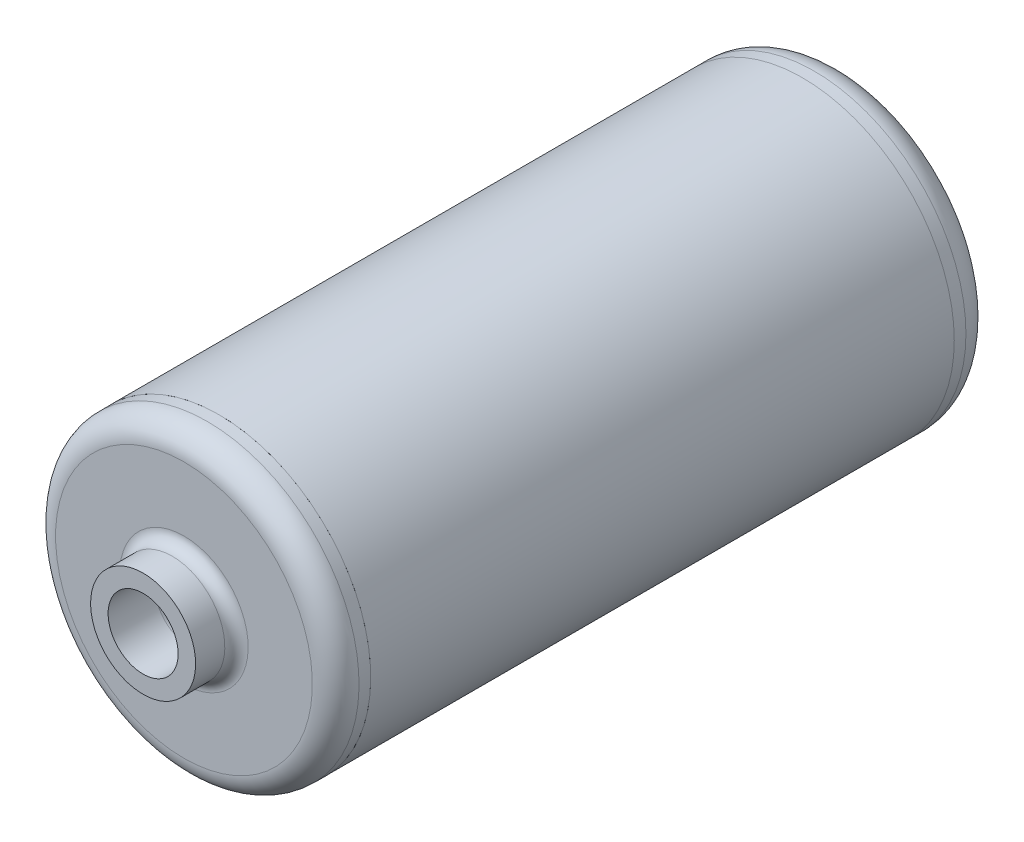
ISO-10303-21;
HEADER;
FILE_DESCRIPTION(('STEP AP214'),'2;1');
FILE_NAME('part.step','',(''),(''),'','','');
FILE_SCHEMA(('AUTOMOTIVE_DESIGN { 1 0 10303 214 1 1 1 1 }'));
ENDSEC;
DATA;
#1=APPLICATION_CONTEXT('core data for automotive mechanical design processes');
#2=APPLICATION_PROTOCOL_DEFINITION('international standard','automotive_design',2000,#1);
#3=PRODUCT_CONTEXT('',#1,'mechanical');
#4=PRODUCT('Part','Part','',(#3));
#5=PRODUCT_RELATED_PRODUCT_CATEGORY('part','',(#4));
#6=PRODUCT_DEFINITION_FORMATION('','',#4);
#7=PRODUCT_DEFINITION_CONTEXT('part definition',#1,'design');
#8=PRODUCT_DEFINITION('design','',#6,#7);
#9=PRODUCT_DEFINITION_SHAPE('','',#8);
#10=(LENGTH_UNIT() NAMED_UNIT(*) SI_UNIT(.MILLI.,.METRE.));
#11=(NAMED_UNIT(*) PLANE_ANGLE_UNIT() SI_UNIT($,.RADIAN.));
#12=(NAMED_UNIT(*) SI_UNIT($,.STERADIAN.) SOLID_ANGLE_UNIT());
#13=UNCERTAINTY_MEASURE_WITH_UNIT(LENGTH_MEASURE(1.E-05),#10,'distance_accuracy_value','');
#14=(GEOMETRIC_REPRESENTATION_CONTEXT(3) GLOBAL_UNCERTAINTY_ASSIGNED_CONTEXT((#13)) GLOBAL_UNIT_ASSIGNED_CONTEXT((#10,
#11,#12)) REPRESENTATION_CONTEXT('',''));
#15=CARTESIAN_POINT('',(0.,0.,0.));
#16=DIRECTION('',(0.,0.,1.));
#17=DIRECTION('',(1.,0.,0.));
#18=AXIS2_PLACEMENT_3D('',#15,#16,#17);
#19=CARTESIAN_POINT('',(0.,22.,-50.));
#20=DIRECTION('',(0.,0.,-1.));
#21=DIRECTION('',(-1.,0.,0.));
#22=AXIS2_PLACEMENT_3D('',#19,#20,#21);
#23=PLANE('',#22);
#24=CARTESIAN_POINT('',(0.,0.,-50.));
#25=DIRECTION('',(0.,0.,1.));
#26=DIRECTION('',(1.,0.,0.));
#27=AXIS2_PLACEMENT_3D('',#24,#25,#26);
#28=CIRCLE('',#27,22.);
#29=CARTESIAN_POINT('',(22.,0.,-50.));
#30=VERTEX_POINT('',#29);
#31=EDGE_CURVE('E73',#30,#30,#28,.T.);
#32=ORIENTED_EDGE('',*,*,#31,.F.);
#33=EDGE_LOOP('',(#32));
#34=FACE_BOUND('',#33,.T.);
#35=CARTESIAN_POINT('',(0.,0.,-50.));
#36=DIRECTION('',(0.,0.,1.));
#37=DIRECTION('',(1.,0.,0.));
#38=AXIS2_PLACEMENT_3D('',#35,#36,#37);
#39=CIRCLE('',#38,26.);
#40=CARTESIAN_POINT('',(26.,0.,-50.));
#41=VERTEX_POINT('',#40);
#42=EDGE_CURVE('E11',#41,#41,#39,.T.);
#43=ORIENTED_EDGE('',*,*,#42,.T.);
#44=EDGE_LOOP('',(#43));
#45=FACE_BOUND('',#44,.T.);
#46=ADVANCED_FACE('F39',(#34,#45),#23,.F.);
#47=CARTESIAN_POINT('',(0.,0.,0.));
#48=DIRECTION('',(0.,0.,1.));
#49=DIRECTION('',(1.,0.,0.));
#50=AXIS2_PLACEMENT_3D('',#47,#48,#49);
#51=CYLINDRICAL_SURFACE('',#50,26.);
#52=ORIENTED_EDGE('',*,*,#42,.F.);
#53=EDGE_LOOP('',(#52));
#54=FACE_BOUND('',#53,.T.);
#55=CARTESIAN_POINT('',(0.,0.,-52.));
#56=DIRECTION('',(0.,0.,1.));
#57=DIRECTION('',(1.,0.,0.));
#58=AXIS2_PLACEMENT_3D('',#55,#56,#57);
#59=CIRCLE('',#58,26.);
#60=CARTESIAN_POINT('',(26.,0.,-52.));
#61=VERTEX_POINT('',#60);
#62=EDGE_CURVE('E45',#61,#61,#59,.T.);
#63=ORIENTED_EDGE('',*,*,#62,.T.);
#64=EDGE_LOOP('',(#63));
#65=FACE_BOUND('',#64,.T.);
#66=ADVANCED_FACE('F80',(#54,#65),#51,.T.);
#67=CARTESIAN_POINT('',(0.,0.,-52.));
#68=DIRECTION('',(0.,0.,1.));
#69=DIRECTION('',(1.,0.,0.));
#70=AXIS2_PLACEMENT_3D('',#67,#68,#69);
#71=TOROIDAL_SURFACE('',#70,21.,5.);
#72=ORIENTED_EDGE('',*,*,#62,.F.);
#73=EDGE_LOOP('',(#72));
#74=FACE_BOUND('',#73,.T.);
#75=CARTESIAN_POINT('',(0.,0.,-57.));
#76=DIRECTION('',(0.,0.,1.));
#77=DIRECTION('',(1.,0.,0.));
#78=AXIS2_PLACEMENT_3D('',#75,#76,#77);
#79=CIRCLE('',#78,21.);
#80=CARTESIAN_POINT('',(21.,0.,-57.));
#81=VERTEX_POINT('',#80);
#82=EDGE_CURVE('E49',#81,#81,#79,.T.);
#83=ORIENTED_EDGE('',*,*,#82,.T.);
#84=EDGE_LOOP('',(#83));
#85=FACE_BOUND('',#84,.T.);
#86=ADVANCED_FACE('F84',(#74,#85),#71,.T.);
#87=CARTESIAN_POINT('',(0.,21.,-57.));
#88=DIRECTION('',(0.,0.,1.));
#89=DIRECTION('',(1.,0.,0.));
#90=AXIS2_PLACEMENT_3D('',#87,#88,#89);
#91=PLANE('',#90);
#92=ORIENTED_EDGE('',*,*,#82,.F.);
#93=EDGE_LOOP('',(#92));
#94=FACE_BOUND('',#93,.T.);
#95=CARTESIAN_POINT('',(0.,0.,-57.));
#96=DIRECTION('',(0.,0.,1.));
#97=DIRECTION('',(1.,0.,0.));
#98=AXIS2_PLACEMENT_3D('',#95,#96,#97);
#99=CIRCLE('',#98,8.00000000000001);
#100=CARTESIAN_POINT('',(8.00000000000001,0.,-57.));
#101=VERTEX_POINT('',#100);
#102=EDGE_CURVE('E53',#101,#101,#99,.T.);
#103=ORIENTED_EDGE('',*,*,#102,.T.);
#104=EDGE_LOOP('',(#103));
#105=FACE_BOUND('',#104,.T.);
#106=ADVANCED_FACE('F89',(#94,#105),#91,.F.);
#107=CARTESIAN_POINT('',(0.,0.,-55.));
#108=DIRECTION('',(0.,0.,1.));
#109=DIRECTION('',(1.,0.,0.));
#110=AXIS2_PLACEMENT_3D('',#107,#108,#109);
#111=TOROIDAL_SURFACE('',#110,8.,2.);
#112=ORIENTED_EDGE('',*,*,#102,.F.);
#113=EDGE_LOOP('',(#112));
#114=FACE_BOUND('',#113,.T.);
#115=CARTESIAN_POINT('',(0.,0.,-55.));
#116=DIRECTION('',(0.,0.,1.));
#117=DIRECTION('',(1.,0.,0.));
#118=AXIS2_PLACEMENT_3D('',#115,#116,#117);
#119=CIRCLE('',#118,6.);
#120=CARTESIAN_POINT('',(6.,0.,-55.));
#121=VERTEX_POINT('',#120);
#122=EDGE_CURVE('E58',#121,#121,#119,.T.);
#123=ORIENTED_EDGE('',*,*,#122,.T.);
#124=EDGE_LOOP('',(#123));
#125=FACE_BOUND('',#124,.T.);
#126=ADVANCED_FACE('F95',(#114,#125),#111,.T.);
#127=CARTESIAN_POINT('',(0.,0.,0.));
#128=DIRECTION('',(0.,0.,1.));
#129=DIRECTION('',(1.,0.,0.));
#130=AXIS2_PLACEMENT_3D('',#127,#128,#129);
#131=CYLINDRICAL_SURFACE('',#130,6.);
#132=ORIENTED_EDGE('',*,*,#122,.F.);
#133=EDGE_LOOP('',(#132));
#134=FACE_BOUND('',#133,.T.);
#135=CARTESIAN_POINT('',(0.,0.,-45.));
#136=DIRECTION('',(0.,0.,1.));
#137=DIRECTION('',(1.,0.,0.));
#138=AXIS2_PLACEMENT_3D('',#135,#136,#137);
#139=CIRCLE('',#138,6.);
#140=CARTESIAN_POINT('',(6.,0.,-45.));
#141=VERTEX_POINT('',#140);
#142=EDGE_CURVE('E61',#141,#141,#139,.T.);
#143=ORIENTED_EDGE('',*,*,#142,.T.);
#144=EDGE_LOOP('',(#143));
#145=FACE_BOUND('',#144,.T.);
#146=ADVANCED_FACE('F99',(#134,#145),#131,.F.);
#147=CARTESIAN_POINT('',(0.,0.,-45.));
#148=DIRECTION('',(0.,0.,1.));
#149=DIRECTION('',(1.,0.,0.));
#150=AXIS2_PLACEMENT_3D('',#147,#148,#149);
#151=TOROIDAL_SURFACE('',#150,8.,2.);
#152=ORIENTED_EDGE('',*,*,#142,.F.);
#153=EDGE_LOOP('',(#152));
#154=FACE_BOUND('',#153,.T.);
#155=CARTESIAN_POINT('',(0.,0.,-43.));
#156=DIRECTION('',(0.,0.,1.));
#157=DIRECTION('',(1.,0.,0.));
#158=AXIS2_PLACEMENT_3D('',#155,#156,#157);
#159=CIRCLE('',#158,8.00000000000001);
#160=CARTESIAN_POINT('',(8.00000000000001,0.,-43.));
#161=VERTEX_POINT('',#160);
#162=EDGE_CURVE('E64',#161,#161,#159,.T.);
#163=ORIENTED_EDGE('',*,*,#162,.T.);
#164=EDGE_LOOP('',(#163));
#165=FACE_BOUND('',#164,.T.);
#166=ADVANCED_FACE('F103',(#154,#165),#151,.T.);
#167=CARTESIAN_POINT('',(0.,8.00000000000001,-43.));
#168=DIRECTION('',(0.,0.,-1.));
#169=DIRECTION('',(-1.,0.,0.));
#170=AXIS2_PLACEMENT_3D('',#167,#168,#169);
#171=PLANE('',#170);
#172=ORIENTED_EDGE('',*,*,#162,.F.);
#173=EDGE_LOOP('',(#172));
#174=FACE_BOUND('',#173,.T.);
#175=CARTESIAN_POINT('',(0.,0.,-43.));
#176=DIRECTION('',(0.,0.,1.));
#177=DIRECTION('',(1.,0.,0.));
#178=AXIS2_PLACEMENT_3D('',#175,#176,#177);
#179=CIRCLE('',#178,20.);
#180=CARTESIAN_POINT('',(20.,0.,-43.));
#181=VERTEX_POINT('',#180);
#182=EDGE_CURVE('E67',#181,#181,#179,.T.);
#183=ORIENTED_EDGE('',*,*,#182,.T.);
#184=EDGE_LOOP('',(#183));
#185=FACE_BOUND('',#184,.T.);
#186=ADVANCED_FACE('F107',(#174,#185),#171,.F.);
#187=CARTESIAN_POINT('',(0.,0.,-45.));
#188=DIRECTION('',(0.,0.,1.));
#189=DIRECTION('',(1.,0.,0.));
#190=AXIS2_PLACEMENT_3D('',#187,#188,#189);
#191=TOROIDAL_SURFACE('',#190,20.,2.);
#192=ORIENTED_EDGE('',*,*,#182,.F.);
#193=EDGE_LOOP('',(#192));
#194=FACE_BOUND('',#193,.T.);
#195=CARTESIAN_POINT('',(0.,0.,-45.));
#196=DIRECTION('',(0.,0.,1.));
#197=DIRECTION('',(1.,0.,0.));
#198=AXIS2_PLACEMENT_3D('',#195,#196,#197);
#199=CIRCLE('',#198,22.);
#200=CARTESIAN_POINT('',(22.,0.,-45.));
#201=VERTEX_POINT('',#200);
#202=EDGE_CURVE('E70',#201,#201,#199,.T.);
#203=ORIENTED_EDGE('',*,*,#202,.T.);
#204=EDGE_LOOP('',(#203));
#205=FACE_BOUND('',#204,.T.);
#206=ADVANCED_FACE('F111',(#194,#205),#191,.T.);
#207=CARTESIAN_POINT('',(0.,0.,0.));
#208=DIRECTION('',(0.,0.,1.));
#209=DIRECTION('',(1.,0.,0.));
#210=AXIS2_PLACEMENT_3D('',#207,#208,#209);
#211=CYLINDRICAL_SURFACE('',#210,22.);
#212=ORIENTED_EDGE('',*,*,#202,.F.);
#213=EDGE_LOOP('',(#212));
#214=FACE_BOUND('',#213,.T.);
#215=ORIENTED_EDGE('',*,*,#31,.T.);
#216=EDGE_LOOP('',(#215));
#217=FACE_BOUND('',#216,.T.);
#218=ADVANCED_FACE('F77',(#214,#217),#211,.T.);
#219=CLOSED_SHELL('',(#46,#66,#86,#106,#126,#146,#166,#186,#206,#218));
#220=MANIFOLD_SOLID_BREP('B2',#219);
#221=CARTESIAN_POINT('',(0.,26.,50.));
#222=DIRECTION('',(0.,0.,-1.));
#223=DIRECTION('',(0.,1.,0.));
#224=AXIS2_PLACEMENT_3D('',#221,#222,#223);
#225=PLANE('',#224);
#226=CARTESIAN_POINT('',(0.,0.,50.));
#227=DIRECTION('',(0.,0.,-1.));
#228=DIRECTION('',(0.,1.,0.));
#229=AXIS2_PLACEMENT_3D('',#226,#227,#228);
#230=CIRCLE('',#229,26.);
#231=CARTESIAN_POINT('',(0.,26.,50.));
#232=VERTEX_POINT('',#231);
#233=EDGE_CURVE('E246',#232,#232,#230,.T.);
#234=ORIENTED_EDGE('',*,*,#233,.T.);
#235=EDGE_LOOP('',(#234));
#236=FACE_BOUND('',#235,.T.);
#237=CARTESIAN_POINT('',(0.,0.,50.));
#238=DIRECTION('',(0.,0.,-1.));
#239=DIRECTION('',(0.,1.,0.));
#240=AXIS2_PLACEMENT_3D('',#237,#238,#239);
#241=CIRCLE('',#240,22.);
#242=CARTESIAN_POINT('',(0.,22.,50.));
#243=VERTEX_POINT('',#242);
#244=EDGE_CURVE('E38',#243,#243,#241,.T.);
#245=ORIENTED_EDGE('',*,*,#244,.F.);
#246=EDGE_LOOP('',(#245));
#247=FACE_BOUND('',#246,.T.);
#248=ADVANCED_FACE('F197',(#236,#247),#225,.T.);
#249=CARTESIAN_POINT('',(0.,0.,-65.9873244020304));
#250=DIRECTION('',(0.,0.,-1.));
#251=DIRECTION('',(0.,1.,0.));
#252=AXIS2_PLACEMENT_3D('',#249,#250,#251);
#253=CYLINDRICAL_SURFACE('',#252,22.);
#254=ORIENTED_EDGE('',*,*,#244,.T.);
#255=EDGE_LOOP('',(#254));
#256=FACE_BOUND('',#255,.T.);
#257=CARTESIAN_POINT('',(0.,0.,43.));
#258=DIRECTION('',(0.,0.,-1.));
#259=DIRECTION('',(0.,1.,0.));
#260=AXIS2_PLACEMENT_3D('',#257,#258,#259);
#261=CIRCLE('',#260,22.);
#262=CARTESIAN_POINT('',(0.,22.,43.));
#263=VERTEX_POINT('',#262);
#264=EDGE_CURVE('E203',#263,#263,#261,.T.);
#265=ORIENTED_EDGE('',*,*,#264,.F.);
#266=EDGE_LOOP('',(#265));
#267=FACE_BOUND('',#266,.T.);
#268=ADVANCED_FACE('F264',(#256,#267),#253,.T.);
#269=CARTESIAN_POINT('',(0.,22.,43.));
#270=DIRECTION('',(0.,0.,-1.));
#271=DIRECTION('',(0.,1.,0.));
#272=AXIS2_PLACEMENT_3D('',#269,#270,#271);
#273=PLANE('',#272);
#274=ORIENTED_EDGE('',*,*,#264,.T.);
#275=EDGE_LOOP('',(#274));
#276=FACE_BOUND('',#275,.T.);
#277=CARTESIAN_POINT('',(0.,0.,43.));
#278=DIRECTION('',(0.,0.,-1.));
#279=DIRECTION('',(0.,1.,0.));
#280=AXIS2_PLACEMENT_3D('',#277,#278,#279);
#281=CIRCLE('',#280,21.);
#282=CARTESIAN_POINT('',(0.,21.,43.));
#283=VERTEX_POINT('',#282);
#284=EDGE_CURVE('E207',#283,#283,#281,.T.);
#285=ORIENTED_EDGE('',*,*,#284,.F.);
#286=EDGE_LOOP('',(#285));
#287=FACE_BOUND('',#286,.T.);
#288=ADVANCED_FACE('F268',(#276,#287),#273,.T.);
#289=CARTESIAN_POINT('',(0.,0.,45.));
#290=DIRECTION('',(0.,0.,-1.));
#291=DIRECTION('',(0.,1.,0.));
#292=AXIS2_PLACEMENT_3D('',#289,#290,#291);
#293=TOROIDAL_SURFACE('',#292,21.,2.);
#294=ORIENTED_EDGE('',*,*,#284,.T.);
#295=EDGE_LOOP('',(#294));
#296=FACE_BOUND('',#295,.T.);
#297=CARTESIAN_POINT('',(0.,0.,45.));
#298=DIRECTION('',(0.,0.,-1.));
#299=DIRECTION('',(0.,1.,0.));
#300=AXIS2_PLACEMENT_3D('',#297,#298,#299);
#301=CIRCLE('',#300,19.);
#302=CARTESIAN_POINT('',(0.,19.,45.));
#303=VERTEX_POINT('',#302);
#304=EDGE_CURVE('E211',#303,#303,#301,.T.);
#305=ORIENTED_EDGE('',*,*,#304,.F.);
#306=EDGE_LOOP('',(#305));
#307=FACE_BOUND('',#306,.T.);
#308=ADVANCED_FACE('F272',(#296,#307),#293,.T.);
#309=CARTESIAN_POINT('',(0.,0.,-65.9873244020304));
#310=DIRECTION('',(0.,0.,-1.));
#311=DIRECTION('',(0.,1.,0.));
#312=AXIS2_PLACEMENT_3D('',#309,#310,#311);
#313=CYLINDRICAL_SURFACE('',#312,19.);
#314=ORIENTED_EDGE('',*,*,#304,.T.);
#315=EDGE_LOOP('',(#314));
#316=FACE_BOUND('',#315,.T.);
#317=CARTESIAN_POINT('',(0.,0.,49.));
#318=DIRECTION('',(0.,0.,-1.));
#319=DIRECTION('',(0.,1.,0.));
#320=AXIS2_PLACEMENT_3D('',#317,#318,#319);
#321=CIRCLE('',#320,19.);
#322=CARTESIAN_POINT('',(0.,19.,49.));
#323=VERTEX_POINT('',#322);
#324=EDGE_CURVE('E216',#323,#323,#321,.T.);
#325=ORIENTED_EDGE('',*,*,#324,.F.);
#326=EDGE_LOOP('',(#325));
#327=FACE_BOUND('',#326,.T.);
#328=ADVANCED_FACE('F278',(#316,#327),#313,.F.);
#329=CARTESIAN_POINT('',(0.,0.,49.));
#330=DIRECTION('',(0.,0.,-1.));
#331=DIRECTION('',(0.,1.,0.));
#332=AXIS2_PLACEMENT_3D('',#329,#330,#331);
#333=TOROIDAL_SURFACE('',#332,15.,4.);
#334=ORIENTED_EDGE('',*,*,#324,.T.);
#335=EDGE_LOOP('',(#334));
#336=FACE_BOUND('',#335,.T.);
#337=CARTESIAN_POINT('',(0.,0.,53.));
#338=DIRECTION('',(0.,0.,-1.));
#339=DIRECTION('',(0.,1.,0.));
#340=AXIS2_PLACEMENT_3D('',#337,#338,#339);
#341=CIRCLE('',#340,15.);
#342=CARTESIAN_POINT('',(0.,15.,53.));
#343=VERTEX_POINT('',#342);
#344=EDGE_CURVE('E219',#343,#343,#341,.T.);
#345=ORIENTED_EDGE('',*,*,#344,.F.);
#346=EDGE_LOOP('',(#345));
#347=FACE_BOUND('',#346,.T.);
#348=ADVANCED_FACE('F282',(#336,#347),#333,.F.);
#349=CARTESIAN_POINT('',(0.,15.,53.));
#350=DIRECTION('',(0.,0.,-1.));
#351=DIRECTION('',(0.,1.,0.));
#352=AXIS2_PLACEMENT_3D('',#349,#350,#351);
#353=PLANE('',#352);
#354=ORIENTED_EDGE('',*,*,#344,.T.);
#355=EDGE_LOOP('',(#354));
#356=FACE_BOUND('',#355,.T.);
#357=CARTESIAN_POINT('',(0.,0.,53.));
#358=DIRECTION('',(0.,0.,-1.));
#359=DIRECTION('',(0.,1.,0.));
#360=AXIS2_PLACEMENT_3D('',#357,#358,#359);
#361=CIRCLE('',#360,8.00000000000001);
#362=CARTESIAN_POINT('',(0.,8.,53.));
#363=VERTEX_POINT('',#362);
#364=EDGE_CURVE('E222',#363,#363,#361,.T.);
#365=ORIENTED_EDGE('',*,*,#364,.F.);
#366=EDGE_LOOP('',(#365));
#367=FACE_BOUND('',#366,.T.);
#368=ADVANCED_FACE('F286',(#356,#367),#353,.T.);
#369=CARTESIAN_POINT('',(0.,0.,55.));
#370=DIRECTION('',(0.,0.,-1.));
#371=DIRECTION('',(0.,1.,0.));
#372=AXIS2_PLACEMENT_3D('',#369,#370,#371);
#373=TOROIDAL_SURFACE('',#372,8.,2.);
#374=ORIENTED_EDGE('',*,*,#364,.T.);
#375=EDGE_LOOP('',(#374));
#376=FACE_BOUND('',#375,.T.);
#377=CARTESIAN_POINT('',(0.,0.,55.));
#378=DIRECTION('',(0.,0.,-1.));
#379=DIRECTION('',(0.,1.,0.));
#380=AXIS2_PLACEMENT_3D('',#377,#378,#379);
#381=CIRCLE('',#380,6.);
#382=CARTESIAN_POINT('',(0.,5.99999999999999,55.));
#383=VERTEX_POINT('',#382);
#384=EDGE_CURVE('E225',#383,#383,#381,.T.);
#385=ORIENTED_EDGE('',*,*,#384,.F.);
#386=EDGE_LOOP('',(#385));
#387=FACE_BOUND('',#386,.T.);
#388=ADVANCED_FACE('F290',(#376,#387),#373,.T.);
#389=CARTESIAN_POINT('',(0.,0.,-65.9873244020304));
#390=DIRECTION('',(0.,0.,-1.));
#391=DIRECTION('',(0.,1.,0.));
#392=AXIS2_PLACEMENT_3D('',#389,#390,#391);
#393=CYLINDRICAL_SURFACE('',#392,6.);
#394=ORIENTED_EDGE('',*,*,#384,.T.);
#395=EDGE_LOOP('',(#394));
#396=FACE_BOUND('',#395,.T.);
#397=CARTESIAN_POINT('',(0.,0.,63.));
#398=DIRECTION('',(0.,0.,-1.));
#399=DIRECTION('',(0.,1.,0.));
#400=AXIS2_PLACEMENT_3D('',#397,#398,#399);
#401=CIRCLE('',#400,6.);
#402=CARTESIAN_POINT('',(0.,5.99999999999998,63.));
#403=VERTEX_POINT('',#402);
#404=EDGE_CURVE('E228',#403,#403,#401,.T.);
#405=ORIENTED_EDGE('',*,*,#404,.F.);
#406=EDGE_LOOP('',(#405));
#407=FACE_BOUND('',#406,.T.);
#408=ADVANCED_FACE('F294',(#396,#407),#393,.F.);
#409=CARTESIAN_POINT('',(0.,5.99999999999998,63.));
#410=DIRECTION('',(0.,0.,1.));
#411=DIRECTION('',(0.,-1.,0.));
#412=AXIS2_PLACEMENT_3D('',#409,#410,#411);
#413=PLANE('',#412);
#414=ORIENTED_EDGE('',*,*,#404,.T.);
#415=EDGE_LOOP('',(#414));
#416=FACE_BOUND('',#415,.T.);
#417=CARTESIAN_POINT('',(0.,0.,63.));
#418=DIRECTION('',(0.,0.,-1.));
#419=DIRECTION('',(0.,1.,0.));
#420=AXIS2_PLACEMENT_3D('',#417,#418,#419);
#421=CIRCLE('',#420,9.);
#422=CARTESIAN_POINT('',(0.,8.99999999999998,63.));
#423=VERTEX_POINT('',#422);
#424=EDGE_CURVE('E231',#423,#423,#421,.T.);
#425=ORIENTED_EDGE('',*,*,#424,.F.);
#426=EDGE_LOOP('',(#425));
#427=FACE_BOUND('',#426,.T.);
#428=ADVANCED_FACE('F298',(#416,#427),#413,.T.);
#429=CARTESIAN_POINT('',(0.,0.,-65.9873244020304));
#430=DIRECTION('',(0.,0.,-1.));
#431=DIRECTION('',(0.,1.,0.));
#432=AXIS2_PLACEMENT_3D('',#429,#430,#431);
#433=CYLINDRICAL_SURFACE('',#432,9.);
#434=ORIENTED_EDGE('',*,*,#424,.T.);
#435=EDGE_LOOP('',(#434));
#436=FACE_BOUND('',#435,.T.);
#437=CARTESIAN_POINT('',(0.,0.,58.));
#438=DIRECTION('',(0.,0.,-1.));
#439=DIRECTION('',(0.,1.,0.));
#440=AXIS2_PLACEMENT_3D('',#437,#438,#439);
#441=CIRCLE('',#440,9.);
#442=CARTESIAN_POINT('',(0.,8.99999999999998,58.));
#443=VERTEX_POINT('',#442);
#444=EDGE_CURVE('E234',#443,#443,#441,.T.);
#445=ORIENTED_EDGE('',*,*,#444,.F.);
#446=EDGE_LOOP('',(#445));
#447=FACE_BOUND('',#446,.T.);
#448=ADVANCED_FACE('F302',(#436,#447),#433,.T.);
#449=CARTESIAN_POINT('',(0.,0.,58.));
#450=DIRECTION('',(0.,0.,-1.));
#451=DIRECTION('',(0.,1.,0.));
#452=AXIS2_PLACEMENT_3D('',#449,#450,#451);
#453=TOROIDAL_SURFACE('',#452,11.,2.);
#454=ORIENTED_EDGE('',*,*,#444,.T.);
#455=EDGE_LOOP('',(#454));
#456=FACE_BOUND('',#455,.T.);
#457=CARTESIAN_POINT('',(0.,0.,56.));
#458=DIRECTION('',(0.,0.,-1.));
#459=DIRECTION('',(0.,1.,0.));
#460=AXIS2_PLACEMENT_3D('',#457,#458,#459);
#461=CIRCLE('',#460,11.);
#462=CARTESIAN_POINT('',(0.,11.,56.));
#463=VERTEX_POINT('',#462);
#464=EDGE_CURVE('E237',#463,#463,#461,.T.);
#465=ORIENTED_EDGE('',*,*,#464,.F.);
#466=EDGE_LOOP('',(#465));
#467=FACE_BOUND('',#466,.T.);
#468=ADVANCED_FACE('F306',(#456,#467),#453,.F.);
#469=CARTESIAN_POINT('',(0.,11.,56.));
#470=DIRECTION('',(0.,0.,1.));
#471=DIRECTION('',(0.,-1.,0.));
#472=AXIS2_PLACEMENT_3D('',#469,#470,#471);
#473=PLANE('',#472);
#474=ORIENTED_EDGE('',*,*,#464,.T.);
#475=EDGE_LOOP('',(#474));
#476=FACE_BOUND('',#475,.T.);
#477=CARTESIAN_POINT('',(0.,0.,56.));
#478=DIRECTION('',(0.,0.,-1.));
#479=DIRECTION('',(0.,1.,0.));
#480=AXIS2_PLACEMENT_3D('',#477,#478,#479);
#481=CIRCLE('',#480,22.);
#482=CARTESIAN_POINT('',(0.,22.,56.));
#483=VERTEX_POINT('',#482);
#484=EDGE_CURVE('E240',#483,#483,#481,.T.);
#485=ORIENTED_EDGE('',*,*,#484,.F.);
#486=EDGE_LOOP('',(#485));
#487=FACE_BOUND('',#486,.T.);
#488=ADVANCED_FACE('F260',(#476,#487),#473,.T.);
#489=CARTESIAN_POINT('',(0.,0.,52.));
#490=DIRECTION('',(0.,0.,-1.));
#491=DIRECTION('',(0.,1.,0.));
#492=AXIS2_PLACEMENT_3D('',#489,#490,#491);
#493=TOROIDAL_SURFACE('',#492,22.,4.);
#494=ORIENTED_EDGE('',*,*,#484,.T.);
#495=EDGE_LOOP('',(#494));
#496=FACE_BOUND('',#495,.T.);
#497=CARTESIAN_POINT('',(0.,0.,52.));
#498=DIRECTION('',(0.,0.,-1.));
#499=DIRECTION('',(0.,1.,0.));
#500=AXIS2_PLACEMENT_3D('',#497,#498,#499);
#501=CIRCLE('',#500,26.);
#502=CARTESIAN_POINT('',(0.,26.,52.));
#503=VERTEX_POINT('',#502);
#504=EDGE_CURVE('E243',#503,#503,#501,.T.);
#505=ORIENTED_EDGE('',*,*,#504,.F.);
#506=EDGE_LOOP('',(#505));
#507=FACE_BOUND('',#506,.T.);
#508=ADVANCED_FACE('F254',(#496,#507),#493,.T.);
#509=CARTESIAN_POINT('',(0.,0.,-65.9873244020304));
#510=DIRECTION('',(0.,0.,-1.));
#511=DIRECTION('',(0.,1.,0.));
#512=AXIS2_PLACEMENT_3D('',#509,#510,#511);
#513=CYLINDRICAL_SURFACE('',#512,26.);
#514=ORIENTED_EDGE('',*,*,#504,.T.);
#515=EDGE_LOOP('',(#514));
#516=FACE_BOUND('',#515,.T.);
#517=ORIENTED_EDGE('',*,*,#233,.F.);
#518=EDGE_LOOP('',(#517));
#519=FACE_BOUND('',#518,.T.);
#520=ADVANCED_FACE('F252',(#516,#519),#513,.T.);
#521=CLOSED_SHELL('',(#248,#268,#288,#308,#328,#348,#368,#388,#408,#428,#448,#468,#488,#508,#520));
#522=MANIFOLD_SOLID_BREP('B6',#521);
#523=CARTESIAN_POINT('',(0.,0.,-50.));
#524=DIRECTION('',(0.,0.,1.));
#525=DIRECTION('',(1.,0.,0.));
#526=AXIS2_PLACEMENT_3D('',#523,#524,#525);
#527=CYLINDRICAL_SURFACE('',#526,26.);
#528=CARTESIAN_POINT('',(0.,0.,-50.));
#529=DIRECTION('',(0.,0.,1.));
#530=DIRECTION('',(1.,0.,0.));
#531=AXIS2_PLACEMENT_3D('',#528,#529,#530);
#532=CIRCLE('',#531,26.);
#533=CARTESIAN_POINT('',(26.,0.,-50.));
#534=VERTEX_POINT('',#533);
#535=EDGE_CURVE('E196',#534,#534,#532,.T.);
#536=ORIENTED_EDGE('',*,*,#535,.T.);
#537=EDGE_LOOP('',(#536));
#538=FACE_BOUND('',#537,.T.);
#539=CARTESIAN_POINT('',(0.,0.,50.));
#540=DIRECTION('',(0.,0.,1.));
#541=DIRECTION('',(1.,0.,0.));
#542=AXIS2_PLACEMENT_3D('',#539,#540,#541);
#543=CIRCLE('',#542,26.);
#544=CARTESIAN_POINT('',(26.,0.,50.));
#545=VERTEX_POINT('',#544);
#546=EDGE_CURVE('E433',#545,#545,#543,.T.);
#547=ORIENTED_EDGE('',*,*,#546,.F.);
#548=EDGE_LOOP('',(#547));
#549=FACE_BOUND('',#548,.T.);
#550=ADVANCED_FACE('F423',(#538,#549),#527,.T.);
#551=CARTESIAN_POINT('',(0.,0.,-50.));
#552=DIRECTION('',(0.,0.,1.));
#553=DIRECTION('',(1.,0.,0.));
#554=AXIS2_PLACEMENT_3D('',#551,#552,#553);
#555=PLANE('',#554);
#556=CARTESIAN_POINT('',(0.,0.,-50.));
#557=DIRECTION('',(0.,0.,1.));
#558=DIRECTION('',(1.,0.,0.));
#559=AXIS2_PLACEMENT_3D('',#556,#557,#558);
#560=CIRCLE('',#559,22.);
#561=CARTESIAN_POINT('',(22.,0.,-50.));
#562=VERTEX_POINT('',#561);
#563=EDGE_CURVE('E429',#562,#562,#560,.T.);
#564=ORIENTED_EDGE('',*,*,#563,.T.);
#565=EDGE_LOOP('',(#564));
#566=FACE_BOUND('',#565,.T.);
#567=ORIENTED_EDGE('',*,*,#535,.F.);
#568=EDGE_LOOP('',(#567));
#569=FACE_BOUND('',#568,.T.);
#570=ADVANCED_FACE('F452',(#566,#569),#555,.F.);
#571=CARTESIAN_POINT('',(0.,0.,-50.));
#572=DIRECTION('',(0.,0.,1.));
#573=DIRECTION('',(1.,0.,0.));
#574=AXIS2_PLACEMENT_3D('',#571,#572,#573);
#575=CYLINDRICAL_SURFACE('',#574,22.);
#576=ORIENTED_EDGE('',*,*,#563,.F.);
#577=EDGE_LOOP('',(#576));
#578=FACE_BOUND('',#577,.T.);
#579=CARTESIAN_POINT('',(0.,0.,50.));
#580=DIRECTION('',(0.,0.,1.));
#581=DIRECTION('',(1.,0.,0.));
#582=AXIS2_PLACEMENT_3D('',#579,#580,#581);
#583=CIRCLE('',#582,22.);
#584=CARTESIAN_POINT('',(22.,0.,50.));
#585=VERTEX_POINT('',#584);
#586=EDGE_CURVE('E437',#585,#585,#583,.T.);
#587=ORIENTED_EDGE('',*,*,#586,.T.);
#588=EDGE_LOOP('',(#587));
#589=FACE_BOUND('',#588,.T.);
#590=ADVANCED_FACE('F443',(#578,#589),#575,.F.);
#591=CARTESIAN_POINT('',(0.,0.,50.));
#592=DIRECTION('',(0.,0.,1.));
#593=DIRECTION('',(1.,0.,0.));
#594=AXIS2_PLACEMENT_3D('',#591,#592,#593);
#595=PLANE('',#594);
#596=ORIENTED_EDGE('',*,*,#546,.T.);
#597=EDGE_LOOP('',(#596));
#598=FACE_BOUND('',#597,.T.);
#599=ORIENTED_EDGE('',*,*,#586,.F.);
#600=EDGE_LOOP('',(#599));
#601=FACE_BOUND('',#600,.T.);
#602=ADVANCED_FACE('F445',(#598,#601),#595,.T.);
#603=CLOSED_SHELL('',(#550,#570,#590,#602));
#604=MANIFOLD_SOLID_BREP('B33',#603);
#605=ADVANCED_BREP_SHAPE_REPRESENTATION('',(#18,#220,#522,#604),#14);
#606=SHAPE_DEFINITION_REPRESENTATION(#9,#605);
ENDSEC;
END-ISO-10303-21;
